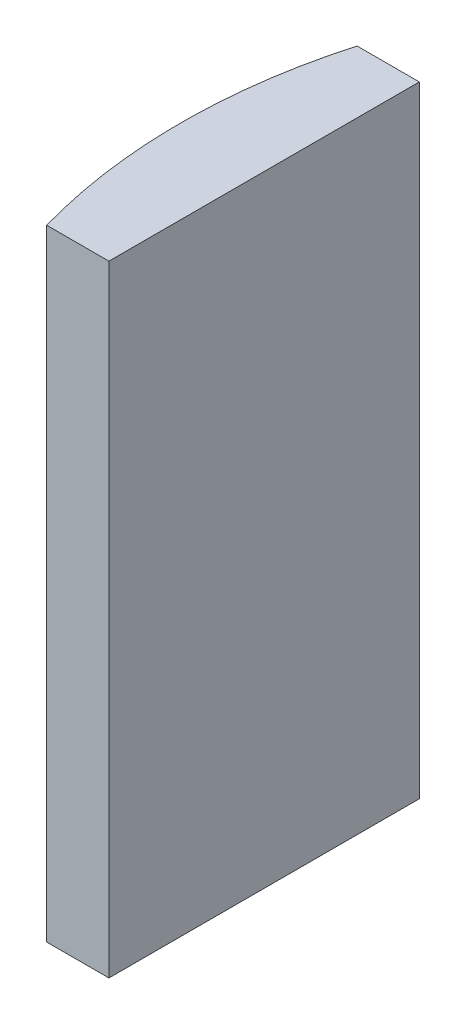
ISO-10303-21;
HEADER;
FILE_DESCRIPTION(('STEP AP214'),'2;1');
FILE_NAME('part.step','',(''),(''),'','','');
FILE_SCHEMA(('AUTOMOTIVE_DESIGN { 1 0 10303 214 1 1 1 1 }'));
ENDSEC;
DATA;
#1=APPLICATION_CONTEXT('core data for automotive mechanical design processes');
#2=APPLICATION_PROTOCOL_DEFINITION('international standard','automotive_design',2000,#1);
#3=PRODUCT_CONTEXT('',#1,'mechanical');
#4=PRODUCT('Part','Part','',(#3));
#5=PRODUCT_RELATED_PRODUCT_CATEGORY('part','',(#4));
#6=PRODUCT_DEFINITION_FORMATION('','',#4);
#7=PRODUCT_DEFINITION_CONTEXT('part definition',#1,'design');
#8=PRODUCT_DEFINITION('design','',#6,#7);
#9=PRODUCT_DEFINITION_SHAPE('','',#8);
#10=(LENGTH_UNIT() NAMED_UNIT(*) SI_UNIT(.MILLI.,.METRE.));
#11=(NAMED_UNIT(*) PLANE_ANGLE_UNIT() SI_UNIT($,.RADIAN.));
#12=(NAMED_UNIT(*) SI_UNIT($,.STERADIAN.) SOLID_ANGLE_UNIT());
#13=UNCERTAINTY_MEASURE_WITH_UNIT(LENGTH_MEASURE(1.E-05),#10,'distance_accuracy_value','');
#14=(GEOMETRIC_REPRESENTATION_CONTEXT(3) GLOBAL_UNCERTAINTY_ASSIGNED_CONTEXT((#13)) GLOBAL_UNIT_ASSIGNED_CONTEXT((#10,
#11,#12)) REPRESENTATION_CONTEXT('',''));
#15=CARTESIAN_POINT('',(0.,0.,0.));
#16=DIRECTION('',(0.,0.,1.));
#17=DIRECTION('',(1.,0.,0.));
#18=AXIS2_PLACEMENT_3D('',#15,#16,#17);
#19=CARTESIAN_POINT('',(4.35520433485127,20.,0.));
#20=DIRECTION('',(0.,-1.,0.));
#21=DIRECTION('',(0.,0.,-1.));
#22=AXIS2_PLACEMENT_3D('',#19,#20,#21);
#23=CYLINDRICAL_SURFACE('',#22,18.32);
#24=CARTESIAN_POINT('',(4.35520433485127,0.,0.));
#25=DIRECTION('',(0.,1.,0.));
#26=DIRECTION('',(0.,0.,1.));
#27=AXIS2_PLACEMENT_3D('',#24,#25,#26);
#28=CIRCLE('',#27,18.32);
#29=CARTESIAN_POINT('',(-13.2692786362886,0.,-5.));
#30=VERTEX_POINT('',#29);
#31=CARTESIAN_POINT('',(-13.2692786362886,0.,5.));
#32=VERTEX_POINT('',#31);
#33=EDGE_CURVE('E100',#30,#32,#28,.T.);
#34=ORIENTED_EDGE('',*,*,#33,.T.);
#35=DIRECTION('',(0.,-1.,0.));
#36=VECTOR('',#35,1.);
#37=CARTESIAN_POINT('',(-13.2692786362886,20.,5.));
#38=LINE('',#37,#36);
#39=CARTESIAN_POINT('',(-13.2692786362886,20.,5.));
#40=VERTEX_POINT('',#39);
#41=EDGE_CURVE('E11',#40,#32,#38,.T.);
#42=ORIENTED_EDGE('',*,*,#41,.F.);
#43=CARTESIAN_POINT('',(4.35520433485127,20.,0.));
#44=DIRECTION('',(0.,1.,0.));
#45=DIRECTION('',(0.,0.,1.));
#46=AXIS2_PLACEMENT_3D('',#43,#44,#45);
#47=CIRCLE('',#46,18.32);
#48=CARTESIAN_POINT('',(-13.2692786362886,20.,-5.));
#49=VERTEX_POINT('',#48);
#50=EDGE_CURVE('E88',#49,#40,#47,.T.);
#51=ORIENTED_EDGE('',*,*,#50,.F.);
#52=DIRECTION('',(0.,-1.,0.));
#53=VECTOR('',#52,1.);
#54=CARTESIAN_POINT('',(-13.2692786362886,20.,-5.));
#55=LINE('',#54,#53);
#56=EDGE_CURVE('E96',#49,#30,#55,.T.);
#57=ORIENTED_EDGE('',*,*,#56,.T.);
#58=EDGE_LOOP('',(#34,#42,#51,#57));
#59=FACE_BOUND('',#58,.T.);
#60=ADVANCED_FACE('F37',(#59),#23,.T.);
#61=CARTESIAN_POINT('',(-13.2692786362886,20.,5.));
#62=DIRECTION('',(0.,0.,-1.));
#63=DIRECTION('',(-1.,0.,0.));
#64=AXIS2_PLACEMENT_3D('',#61,#62,#63);
#65=PLANE('',#64);
#66=DIRECTION('',(1.,0.,0.));
#67=VECTOR('',#66,1.);
#68=CARTESIAN_POINT('',(-13.2692786362886,0.,5.));
#69=LINE('',#68,#67);
#70=CARTESIAN_POINT('',(-11.2647956651487,0.,5.));
#71=VERTEX_POINT('',#70);
#72=EDGE_CURVE('E92',#32,#71,#69,.T.);
#73=ORIENTED_EDGE('',*,*,#72,.T.);
#74=DIRECTION('',(0.,-1.,0.));
#75=VECTOR('',#74,1.);
#76=CARTESIAN_POINT('',(-11.2647956651487,20.,5.));
#77=LINE('',#76,#75);
#78=CARTESIAN_POINT('',(-11.2647956651487,20.,5.));
#79=VERTEX_POINT('',#78);
#80=EDGE_CURVE('E45',#79,#71,#77,.T.);
#81=ORIENTED_EDGE('',*,*,#80,.F.);
#82=DIRECTION('',(1.,0.,0.));
#83=VECTOR('',#82,1.);
#84=CARTESIAN_POINT('',(-13.2692786362886,20.,5.));
#85=LINE('',#84,#83);
#86=EDGE_CURVE('E83',#40,#79,#85,.T.);
#87=ORIENTED_EDGE('',*,*,#86,.F.);
#88=ORIENTED_EDGE('',*,*,#41,.T.);
#89=EDGE_LOOP('',(#73,#81,#87,#88));
#90=FACE_BOUND('',#89,.T.);
#91=ADVANCED_FACE('F91',(#90),#65,.F.);
#92=CARTESIAN_POINT('',(-11.2647956651487,20.,-5.));
#93=DIRECTION('',(-1.,0.,0.));
#94=DIRECTION('',(0.,0.,1.));
#95=AXIS2_PLACEMENT_3D('',#92,#93,#94);
#96=PLANE('',#95);
#97=DIRECTION('',(0.,0.,-1.));
#98=VECTOR('',#97,1.);
#99=CARTESIAN_POINT('',(-11.2647956651487,0.,-5.));
#100=LINE('',#99,#98);
#101=CARTESIAN_POINT('',(-11.2647956651487,0.,-5.));
#102=VERTEX_POINT('',#101);
#103=EDGE_CURVE('E70',#71,#102,#100,.T.);
#104=ORIENTED_EDGE('',*,*,#103,.T.);
#105=DIRECTION('',(0.,-1.,0.));
#106=VECTOR('',#105,1.);
#107=CARTESIAN_POINT('',(-11.2647956651487,20.,-5.));
#108=LINE('',#107,#106);
#109=CARTESIAN_POINT('',(-11.2647956651487,20.,-5.));
#110=VERTEX_POINT('',#109);
#111=EDGE_CURVE('E93',#110,#102,#108,.T.);
#112=ORIENTED_EDGE('',*,*,#111,.F.);
#113=DIRECTION('',(0.,0.,-1.));
#114=VECTOR('',#113,1.);
#115=CARTESIAN_POINT('',(-11.2647956651487,20.,-5.));
#116=LINE('',#115,#114);
#117=EDGE_CURVE('E86',#79,#110,#116,.T.);
#118=ORIENTED_EDGE('',*,*,#117,.F.);
#119=ORIENTED_EDGE('',*,*,#80,.T.);
#120=EDGE_LOOP('',(#104,#112,#118,#119));
#121=FACE_BOUND('',#120,.T.);
#122=ADVANCED_FACE('F94',(#121),#96,.F.);
#123=CARTESIAN_POINT('',(-13.2692786362886,20.,-5.));
#124=DIRECTION('',(0.,0.,1.));
#125=DIRECTION('',(1.,0.,0.));
#126=AXIS2_PLACEMENT_3D('',#123,#124,#125);
#127=PLANE('',#126);
#128=DIRECTION('',(-1.,0.,0.));
#129=VECTOR('',#128,1.);
#130=CARTESIAN_POINT('',(-13.2692786362886,0.,-5.));
#131=LINE('',#130,#129);
#132=EDGE_CURVE('E76',#102,#30,#131,.T.);
#133=ORIENTED_EDGE('',*,*,#132,.T.);
#134=ORIENTED_EDGE('',*,*,#56,.F.);
#135=DIRECTION('',(-1.,0.,0.));
#136=VECTOR('',#135,1.);
#137=CARTESIAN_POINT('',(-13.2692786362886,20.,-5.));
#138=LINE('',#137,#136);
#139=EDGE_CURVE('E53',#110,#49,#138,.T.);
#140=ORIENTED_EDGE('',*,*,#139,.F.);
#141=ORIENTED_EDGE('',*,*,#111,.T.);
#142=EDGE_LOOP('',(#133,#134,#140,#141));
#143=FACE_BOUND('',#142,.T.);
#144=ADVANCED_FACE('F107',(#143),#127,.F.);
#145=CARTESIAN_POINT('',(4.35520433485127,20.,0.));
#146=DIRECTION('',(0.,1.,0.));
#147=DIRECTION('',(0.,0.,1.));
#148=AXIS2_PLACEMENT_3D('',#145,#146,#147);
#149=PLANE('',#148);
#150=ORIENTED_EDGE('',*,*,#50,.T.);
#151=ORIENTED_EDGE('',*,*,#86,.T.);
#152=ORIENTED_EDGE('',*,*,#117,.T.);
#153=ORIENTED_EDGE('',*,*,#139,.T.);
#154=EDGE_LOOP('',(#150,#151,#152,#153));
#155=FACE_BOUND('',#154,.T.);
#156=ADVANCED_FACE('F84',(#155),#149,.T.);
#157=CARTESIAN_POINT('',(4.35520433485127,0.,0.));
#158=DIRECTION('',(0.,1.,0.));
#159=DIRECTION('',(0.,0.,1.));
#160=AXIS2_PLACEMENT_3D('',#157,#158,#159);
#161=PLANE('',#160);
#162=ORIENTED_EDGE('',*,*,#33,.F.);
#163=ORIENTED_EDGE('',*,*,#132,.F.);
#164=ORIENTED_EDGE('',*,*,#103,.F.);
#165=ORIENTED_EDGE('',*,*,#72,.F.);
#166=EDGE_LOOP('',(#162,#163,#164,#165));
#167=FACE_BOUND('',#166,.T.);
#168=ADVANCED_FACE('F110',(#167),#161,.F.);
#169=CLOSED_SHELL('',(#60,#91,#122,#144,#156,#168));
#170=MANIFOLD_SOLID_BREP('B2',#169);
#171=ADVANCED_BREP_SHAPE_REPRESENTATION('',(#18,#170),#14);
#172=SHAPE_DEFINITION_REPRESENTATION(#9,#171);
ENDSEC;
END-ISO-10303-21;
